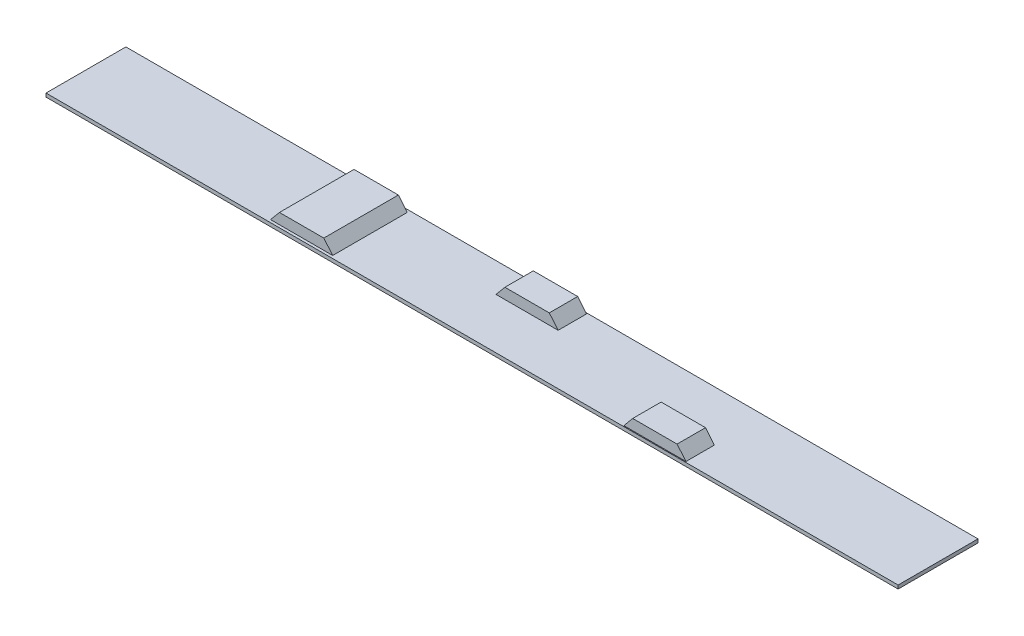
ISO-10303-21;
HEADER;
FILE_DESCRIPTION(('STEP AP214'),'2;1');
FILE_NAME('part.step','',(''),(''),'','','');
FILE_SCHEMA(('AUTOMOTIVE_DESIGN { 1 0 10303 214 1 1 1 1 }'));
ENDSEC;
DATA;
#1=APPLICATION_CONTEXT('core data for automotive mechanical design processes');
#2=APPLICATION_PROTOCOL_DEFINITION('international standard','automotive_design',2000,#1);
#3=PRODUCT_CONTEXT('',#1,'mechanical');
#4=PRODUCT('Part','Part','',(#3));
#5=PRODUCT_RELATED_PRODUCT_CATEGORY('part','',(#4));
#6=PRODUCT_DEFINITION_FORMATION('','',#4);
#7=PRODUCT_DEFINITION_CONTEXT('part definition',#1,'design');
#8=PRODUCT_DEFINITION('design','',#6,#7);
#9=PRODUCT_DEFINITION_SHAPE('','',#8);
#10=(LENGTH_UNIT() NAMED_UNIT(*) SI_UNIT(.MILLI.,.METRE.));
#11=(NAMED_UNIT(*) PLANE_ANGLE_UNIT() SI_UNIT($,.RADIAN.));
#12=(NAMED_UNIT(*) SI_UNIT($,.STERADIAN.) SOLID_ANGLE_UNIT());
#13=UNCERTAINTY_MEASURE_WITH_UNIT(LENGTH_MEASURE(1.E-05),#10,'distance_accuracy_value','');
#14=(GEOMETRIC_REPRESENTATION_CONTEXT(3) GLOBAL_UNCERTAINTY_ASSIGNED_CONTEXT((#13)) GLOBAL_UNIT_ASSIGNED_CONTEXT((#10,
#11,#12)) REPRESENTATION_CONTEXT('',''));
#15=CARTESIAN_POINT('',(0.,0.,0.));
#16=DIRECTION('',(0.,0.,1.));
#17=DIRECTION('',(1.,0.,0.));
#18=AXIS2_PLACEMENT_3D('',#15,#16,#17);
#19=CARTESIAN_POINT('',(0.,10.,0.));
#20=DIRECTION('',(0.,1.,0.));
#21=DIRECTION('',(0.,0.,1.));
#22=AXIS2_PLACEMENT_3D('',#19,#20,#21);
#23=PLANE('',#22);
#24=DIRECTION('',(0.,0.,-1.));
#25=VECTOR('',#24,1.);
#26=CARTESIAN_POINT('',(1200.,10.,-112.5));
#27=LINE('',#26,#25);
#28=CARTESIAN_POINT('',(1200.,10.,112.5));
#29=VERTEX_POINT('',#28);
#30=CARTESIAN_POINT('',(1200.,10.,-112.5));
#31=VERTEX_POINT('',#30);
#32=EDGE_CURVE('E249',#29,#31,#27,.T.);
#33=ORIENTED_EDGE('',*,*,#32,.T.);
#34=DIRECTION('',(-1.,0.,0.));
#35=VECTOR('',#34,1.);
#36=CARTESIAN_POINT('',(-1200.,10.,-112.5));
#37=LINE('',#36,#35);
#38=CARTESIAN_POINT('',(-1200.,10.,-112.5));
#39=VERTEX_POINT('',#38);
#40=EDGE_CURVE('E252',#31,#39,#37,.T.);
#41=ORIENTED_EDGE('',*,*,#40,.T.);
#42=DIRECTION('',(0.,0.,1.));
#43=VECTOR('',#42,1.);
#44=CARTESIAN_POINT('',(-1200.,10.,-112.5));
#45=LINE('',#44,#43);
#46=CARTESIAN_POINT('',(-1200.,10.,112.5));
#47=VERTEX_POINT('',#46);
#48=EDGE_CURVE('E255',#39,#47,#45,.T.);
#49=ORIENTED_EDGE('',*,*,#48,.T.);
#50=DIRECTION('',(1.,0.,0.));
#51=VECTOR('',#50,1.);
#52=CARTESIAN_POINT('',(-1200.,10.,112.5));
#53=LINE('',#52,#51);
#54=EDGE_CURVE('E257',#47,#29,#53,.T.);
#55=ORIENTED_EDGE('',*,*,#54,.T.);
#56=EDGE_LOOP('',(#33,#41,#49,#55));
#57=FACE_BOUND('',#56,.T.);
#58=DIRECTION('',(0.,0.,-1.));
#59=VECTOR('',#58,1.);
#60=CARTESIAN_POINT('',(599.999999999999,10.,110.));
#61=LINE('',#60,#59);
#62=CARTESIAN_POINT('',(599.999999999999,10.,110.));
#63=VERTEX_POINT('',#62);
#64=CARTESIAN_POINT('',(599.999999999999,10.,30.));
#65=VERTEX_POINT('',#64);
#66=EDGE_CURVE('E245',#63,#65,#61,.T.);
#67=ORIENTED_EDGE('',*,*,#66,.F.);
#68=DIRECTION('',(1.,0.,0.));
#69=VECTOR('',#68,1.);
#70=CARTESIAN_POINT('',(599.999999999999,10.,110.));
#71=LINE('',#70,#69);
#72=CARTESIAN_POINT('',(424.999999999999,10.,110.));
#73=VERTEX_POINT('',#72);
#74=EDGE_CURVE('E219',#73,#63,#71,.T.);
#75=ORIENTED_EDGE('',*,*,#74,.F.);
#76=DIRECTION('',(0.,0.,-1.));
#77=VECTOR('',#76,1.);
#78=CARTESIAN_POINT('',(424.999999999999,10.,110.));
#79=LINE('',#78,#77);
#80=CARTESIAN_POINT('',(424.999999999999,10.,30.));
#81=VERTEX_POINT('',#80);
#82=EDGE_CURVE('E230',#73,#81,#79,.T.);
#83=ORIENTED_EDGE('',*,*,#82,.T.);
#84=DIRECTION('',(1.,0.,0.));
#85=VECTOR('',#84,1.);
#86=CARTESIAN_POINT('',(599.999999999999,10.,30.));
#87=LINE('',#86,#85);
#88=EDGE_CURVE('E213',#81,#65,#87,.T.);
#89=ORIENTED_EDGE('',*,*,#88,.T.);
#90=EDGE_LOOP('',(#67,#75,#83,#89));
#91=FACE_BOUND('',#90,.T.);
#92=DIRECTION('',(0.,0.,1.));
#93=VECTOR('',#92,1.);
#94=CARTESIAN_POINT('',(-75.0000000000006,9.99999999999651,-110.));
#95=LINE('',#94,#93);
#96=CARTESIAN_POINT('',(-74.9999999999977,10.,-110.));
#97=VERTEX_POINT('',#96);
#98=CARTESIAN_POINT('',(-75.0000000000006,10.,-30.));
#99=VERTEX_POINT('',#98);
#100=EDGE_CURVE('E210',#97,#99,#95,.T.);
#101=ORIENTED_EDGE('',*,*,#100,.F.);
#102=DIRECTION('',(1.,0.,0.));
#103=VECTOR('',#102,1.);
#104=CARTESIAN_POINT('',(-75.0000000000006,9.99999999999651,-110.));
#105=LINE('',#104,#103);
#106=CARTESIAN_POINT('',(99.9999999999965,10.,-110.));
#107=VERTEX_POINT('',#106);
#108=EDGE_CURVE('E187',#97,#107,#105,.T.);
#109=ORIENTED_EDGE('',*,*,#108,.T.);
#110=DIRECTION('',(0.,0.,1.));
#111=VECTOR('',#110,1.);
#112=CARTESIAN_POINT('',(99.9999999999994,9.99999999999651,-110.));
#113=LINE('',#112,#111);
#114=CARTESIAN_POINT('',(99.9999999999994,9.99999999999651,-30.));
#115=VERTEX_POINT('',#114);
#116=EDGE_CURVE('E199',#107,#115,#113,.T.);
#117=ORIENTED_EDGE('',*,*,#116,.T.);
#118=DIRECTION('',(1.,0.,0.));
#119=VECTOR('',#118,1.);
#120=CARTESIAN_POINT('',(-75.0000000000006,9.99999999999651,-30.));
#121=LINE('',#120,#119);
#122=EDGE_CURVE('E183',#99,#115,#121,.T.);
#123=ORIENTED_EDGE('',*,*,#122,.F.);
#124=EDGE_LOOP('',(#101,#109,#117,#123));
#125=FACE_BOUND('',#124,.T.);
#126=DIRECTION('',(0.,0.,1.));
#127=VECTOR('',#126,1.);
#128=CARTESIAN_POINT('',(-575.000000000001,9.99999999999302,-105.));
#129=LINE('',#128,#127);
#130=CARTESIAN_POINT('',(-574.999999999995,10.,-105.));
#131=VERTEX_POINT('',#130);
#132=CARTESIAN_POINT('',(-575.000000000001,10.,105.));
#133=VERTEX_POINT('',#132);
#134=EDGE_CURVE('E57',#131,#133,#129,.T.);
#135=ORIENTED_EDGE('',*,*,#134,.F.);
#136=DIRECTION('',(1.,0.,0.));
#137=VECTOR('',#136,1.);
#138=CARTESIAN_POINT('',(-575.000000000001,9.99999999999302,-105.));
#139=LINE('',#138,#137);
#140=CARTESIAN_POINT('',(-400.000000000006,10.,-105.));
#141=VERTEX_POINT('',#140);
#142=EDGE_CURVE('E52',#131,#141,#139,.T.);
#143=ORIENTED_EDGE('',*,*,#142,.T.);
#144=DIRECTION('',(0.,0.,1.));
#145=VECTOR('',#144,1.);
#146=CARTESIAN_POINT('',(-400.000000000001,9.99999999999302,-105.));
#147=LINE('',#146,#145);
#148=CARTESIAN_POINT('',(-400.000000000001,9.99999999999302,105.));
#149=VERTEX_POINT('',#148);
#150=EDGE_CURVE('E184',#141,#149,#147,.T.);
#151=ORIENTED_EDGE('',*,*,#150,.T.);
#152=DIRECTION('',(1.,0.,0.));
#153=VECTOR('',#152,1.);
#154=CARTESIAN_POINT('',(-575.000000000001,9.99999999999302,105.));
#155=LINE('',#154,#153);
#156=EDGE_CURVE('E165',#133,#149,#155,.T.);
#157=ORIENTED_EDGE('',*,*,#156,.F.);
#158=EDGE_LOOP('',(#135,#143,#151,#157));
#159=FACE_BOUND('',#158,.T.);
#160=ADVANCED_FACE('F37',(#57,#91,#125,#159),#23,.T.);
#161=CARTESIAN_POINT('',(1200.,10.,-112.5));
#162=DIRECTION('',(-1.,0.,0.));
#163=DIRECTION('',(0.,0.,1.));
#164=AXIS2_PLACEMENT_3D('',#161,#162,#163);
#165=PLANE('',#164);
#166=DIRECTION('',(0.,0.,-1.));
#167=VECTOR('',#166,1.);
#168=CARTESIAN_POINT('',(1200.,0.,-112.5));
#169=LINE('',#168,#167);
#170=CARTESIAN_POINT('',(1200.,0.,112.5));
#171=VERTEX_POINT('',#170);
#172=CARTESIAN_POINT('',(1200.,0.,-112.5));
#173=VERTEX_POINT('',#172);
#174=EDGE_CURVE('E248',#171,#173,#169,.T.);
#175=ORIENTED_EDGE('',*,*,#174,.T.);
#176=DIRECTION('',(0.,-1.,0.));
#177=VECTOR('',#176,1.);
#178=CARTESIAN_POINT('',(1200.,10.,-112.5));
#179=LINE('',#178,#177);
#180=EDGE_CURVE('E11',#31,#173,#179,.T.);
#181=ORIENTED_EDGE('',*,*,#180,.F.);
#182=ORIENTED_EDGE('',*,*,#32,.F.);
#183=DIRECTION('',(0.,-1.,0.));
#184=VECTOR('',#183,1.);
#185=CARTESIAN_POINT('',(1200.,10.,112.5));
#186=LINE('',#185,#184);
#187=EDGE_CURVE('E259',#29,#171,#186,.T.);
#188=ORIENTED_EDGE('',*,*,#187,.T.);
#189=EDGE_LOOP('',(#175,#181,#182,#188));
#190=FACE_BOUND('',#189,.T.);
#191=ADVANCED_FACE('F39',(#190),#165,.F.);
#192=CARTESIAN_POINT('',(-1200.,10.,-112.5));
#193=DIRECTION('',(0.,0.,1.));
#194=DIRECTION('',(1.,0.,0.));
#195=AXIS2_PLACEMENT_3D('',#192,#193,#194);
#196=PLANE('',#195);
#197=DIRECTION('',(-1.,0.,0.));
#198=VECTOR('',#197,1.);
#199=CARTESIAN_POINT('',(-1200.,0.,-112.5));
#200=LINE('',#199,#198);
#201=CARTESIAN_POINT('',(-1200.,0.,-112.5));
#202=VERTEX_POINT('',#201);
#203=EDGE_CURVE('E262',#173,#202,#200,.T.);
#204=ORIENTED_EDGE('',*,*,#203,.T.);
#205=DIRECTION('',(0.,-1.,0.));
#206=VECTOR('',#205,1.);
#207=CARTESIAN_POINT('',(-1200.,10.,-112.5));
#208=LINE('',#207,#206);
#209=EDGE_CURVE('E45',#39,#202,#208,.T.);
#210=ORIENTED_EDGE('',*,*,#209,.F.);
#211=ORIENTED_EDGE('',*,*,#40,.F.);
#212=ORIENTED_EDGE('',*,*,#180,.T.);
#213=EDGE_LOOP('',(#204,#210,#211,#212));
#214=FACE_BOUND('',#213,.T.);
#215=ADVANCED_FACE('F292',(#214),#196,.F.);
#216=CARTESIAN_POINT('',(-1200.,10.,-112.5));
#217=DIRECTION('',(1.,0.,0.));
#218=DIRECTION('',(0.,0.,-1.));
#219=AXIS2_PLACEMENT_3D('',#216,#217,#218);
#220=PLANE('',#219);
#221=DIRECTION('',(0.,0.,1.));
#222=VECTOR('',#221,1.);
#223=CARTESIAN_POINT('',(-1200.,0.,-112.5));
#224=LINE('',#223,#222);
#225=CARTESIAN_POINT('',(-1200.,0.,112.5));
#226=VERTEX_POINT('',#225);
#227=EDGE_CURVE('E264',#202,#226,#224,.T.);
#228=ORIENTED_EDGE('',*,*,#227,.T.);
#229=DIRECTION('',(0.,-1.,0.));
#230=VECTOR('',#229,1.);
#231=CARTESIAN_POINT('',(-1200.,10.,112.5));
#232=LINE('',#231,#230);
#233=EDGE_CURVE('E269',#47,#226,#232,.T.);
#234=ORIENTED_EDGE('',*,*,#233,.F.);
#235=ORIENTED_EDGE('',*,*,#48,.F.);
#236=ORIENTED_EDGE('',*,*,#209,.T.);
#237=EDGE_LOOP('',(#228,#234,#235,#236));
#238=FACE_BOUND('',#237,.T.);
#239=ADVANCED_FACE('F276',(#238),#220,.F.);
#240=CARTESIAN_POINT('',(-1200.,10.,112.5));
#241=DIRECTION('',(0.,0.,-1.));
#242=DIRECTION('',(-1.,0.,0.));
#243=AXIS2_PLACEMENT_3D('',#240,#241,#242);
#244=PLANE('',#243);
#245=DIRECTION('',(1.,0.,0.));
#246=VECTOR('',#245,1.);
#247=CARTESIAN_POINT('',(-1200.,0.,112.5));
#248=LINE('',#247,#246);
#249=EDGE_CURVE('E253',#226,#171,#248,.T.);
#250=ORIENTED_EDGE('',*,*,#249,.T.);
#251=ORIENTED_EDGE('',*,*,#187,.F.);
#252=ORIENTED_EDGE('',*,*,#54,.F.);
#253=ORIENTED_EDGE('',*,*,#233,.T.);
#254=EDGE_LOOP('',(#250,#251,#252,#253));
#255=FACE_BOUND('',#254,.T.);
#256=ADVANCED_FACE('F285',(#255),#244,.F.);
#257=CARTESIAN_POINT('',(0.,0.,0.));
#258=DIRECTION('',(0.,1.,0.));
#259=DIRECTION('',(0.,0.,1.));
#260=AXIS2_PLACEMENT_3D('',#257,#258,#259);
#261=PLANE('',#260);
#262=ORIENTED_EDGE('',*,*,#174,.F.);
#263=ORIENTED_EDGE('',*,*,#249,.F.);
#264=ORIENTED_EDGE('',*,*,#227,.F.);
#265=ORIENTED_EDGE('',*,*,#203,.F.);
#266=EDGE_LOOP('',(#262,#263,#264,#265));
#267=FACE_BOUND('',#266,.T.);
#268=ADVANCED_FACE('F282',(#267),#261,.F.);
#269=CARTESIAN_POINT('',(574.999999999999,40.,110.));
#270=DIRECTION('',(-0.768221279597375,-0.640184399664481,0.));
#271=DIRECTION('',(0.640184399664481,-0.768221279597375,0.));
#272=AXIS2_PLACEMENT_3D('',#269,#270,#271);
#273=PLANE('',#272);
#274=DIRECTION('',(-0.640184399664481,0.768221279597375,0.));
#275=VECTOR('',#274,1.);
#276=CARTESIAN_POINT('',(574.999999999999,40.,30.));
#277=LINE('',#276,#275);
#278=CARTESIAN_POINT('',(574.999999999999,40.,30.));
#279=VERTEX_POINT('',#278);
#280=EDGE_CURVE('E232',#65,#279,#277,.T.);
#281=ORIENTED_EDGE('',*,*,#280,.T.);
#282=DIRECTION('',(0.,0.,-1.));
#283=VECTOR('',#282,1.);
#284=CARTESIAN_POINT('',(574.999999999999,40.,110.));
#285=LINE('',#284,#283);
#286=CARTESIAN_POINT('',(574.999999999999,40.,110.));
#287=VERTEX_POINT('',#286);
#288=EDGE_CURVE('E242',#287,#279,#285,.T.);
#289=ORIENTED_EDGE('',*,*,#288,.F.);
#290=DIRECTION('',(-0.640184399664481,0.768221279597375,0.));
#291=VECTOR('',#290,1.);
#292=CARTESIAN_POINT('',(574.999999999999,40.,110.));
#293=LINE('',#292,#291);
#294=EDGE_CURVE('E222',#63,#287,#293,.T.);
#295=ORIENTED_EDGE('',*,*,#294,.F.);
#296=ORIENTED_EDGE('',*,*,#66,.T.);
#297=EDGE_LOOP('',(#281,#289,#295,#296));
#298=FACE_BOUND('',#297,.T.);
#299=ADVANCED_FACE('F305',(#298),#273,.F.);
#300=CARTESIAN_POINT('',(449.999999999999,40.,110.));
#301=DIRECTION('',(0.,-1.,0.));
#302=DIRECTION('',(0.,0.,-1.));
#303=AXIS2_PLACEMENT_3D('',#300,#301,#302);
#304=PLANE('',#303);
#305=DIRECTION('',(-1.,0.,0.));
#306=VECTOR('',#305,1.);
#307=CARTESIAN_POINT('',(449.999999999999,40.,30.));
#308=LINE('',#307,#306);
#309=CARTESIAN_POINT('',(449.999999999999,40.,30.));
#310=VERTEX_POINT('',#309);
#311=EDGE_CURVE('E234',#279,#310,#308,.T.);
#312=ORIENTED_EDGE('',*,*,#311,.T.);
#313=DIRECTION('',(0.,0.,-1.));
#314=VECTOR('',#313,1.);
#315=CARTESIAN_POINT('',(449.999999999999,40.,110.));
#316=LINE('',#315,#314);
#317=CARTESIAN_POINT('',(449.999999999999,40.,110.));
#318=VERTEX_POINT('',#317);
#319=EDGE_CURVE('E239',#318,#310,#316,.T.);
#320=ORIENTED_EDGE('',*,*,#319,.F.);
#321=DIRECTION('',(-1.,0.,0.));
#322=VECTOR('',#321,1.);
#323=CARTESIAN_POINT('',(449.999999999999,40.,110.));
#324=LINE('',#323,#322);
#325=EDGE_CURVE('E225',#287,#318,#324,.T.);
#326=ORIENTED_EDGE('',*,*,#325,.F.);
#327=ORIENTED_EDGE('',*,*,#288,.T.);
#328=EDGE_LOOP('',(#312,#320,#326,#327));
#329=FACE_BOUND('',#328,.T.);
#330=ADVANCED_FACE('F324',(#329),#304,.F.);
#331=CARTESIAN_POINT('',(424.999999999999,10.,110.));
#332=DIRECTION('',(0.768221279597375,-0.640184399664481,0.));
#333=DIRECTION('',(0.640184399664481,0.768221279597375,0.));
#334=AXIS2_PLACEMENT_3D('',#331,#332,#333);
#335=PLANE('',#334);
#336=DIRECTION('',(-0.640184399664481,-0.768221279597375,0.));
#337=VECTOR('',#336,1.);
#338=CARTESIAN_POINT('',(424.999999999999,10.,30.));
#339=LINE('',#338,#337);
#340=EDGE_CURVE('E223',#310,#81,#339,.T.);
#341=ORIENTED_EDGE('',*,*,#340,.T.);
#342=ORIENTED_EDGE('',*,*,#82,.F.);
#343=DIRECTION('',(-0.640184399664481,-0.768221279597375,0.));
#344=VECTOR('',#343,1.);
#345=CARTESIAN_POINT('',(424.999999999999,10.,110.));
#346=LINE('',#345,#344);
#347=EDGE_CURVE('E227',#318,#73,#346,.T.);
#348=ORIENTED_EDGE('',*,*,#347,.F.);
#349=ORIENTED_EDGE('',*,*,#319,.T.);
#350=EDGE_LOOP('',(#341,#342,#348,#349));
#351=FACE_BOUND('',#350,.T.);
#352=ADVANCED_FACE('F331',(#351),#335,.F.);
#353=CARTESIAN_POINT('',(0.,0.,110.));
#354=DIRECTION('',(0.,0.,-1.));
#355=DIRECTION('',(-1.,0.,0.));
#356=AXIS2_PLACEMENT_3D('',#353,#354,#355);
#357=PLANE('',#356);
#358=ORIENTED_EDGE('',*,*,#74,.T.);
#359=ORIENTED_EDGE('',*,*,#294,.T.);
#360=ORIENTED_EDGE('',*,*,#325,.T.);
#361=ORIENTED_EDGE('',*,*,#347,.T.);
#362=EDGE_LOOP('',(#358,#359,#360,#361));
#363=FACE_BOUND('',#362,.T.);
#364=ADVANCED_FACE('F338',(#363),#357,.F.);
#365=CARTESIAN_POINT('',(0.,0.,30.));
#366=DIRECTION('',(0.,0.,-1.));
#367=DIRECTION('',(-1.,0.,0.));
#368=AXIS2_PLACEMENT_3D('',#365,#366,#367);
#369=PLANE('',#368);
#370=ORIENTED_EDGE('',*,*,#88,.F.);
#371=ORIENTED_EDGE('',*,*,#340,.F.);
#372=ORIENTED_EDGE('',*,*,#311,.F.);
#373=ORIENTED_EDGE('',*,*,#280,.F.);
#374=EDGE_LOOP('',(#370,#371,#372,#373));
#375=FACE_BOUND('',#374,.T.);
#376=ADVANCED_FACE('F346',(#375),#369,.T.);
#377=CARTESIAN_POINT('',(-50.0000000000006,39.9999999999965,-110.));
#378=DIRECTION('',(-0.768221279597375,0.640184399664481,0.));
#379=DIRECTION('',(-0.640184399664481,-0.768221279597375,0.));
#380=AXIS2_PLACEMENT_3D('',#377,#378,#379);
#381=PLANE('',#380);
#382=DIRECTION('',(-0.640184399664481,-0.768221279597375,0.));
#383=VECTOR('',#382,1.);
#384=CARTESIAN_POINT('',(-50.0000000000006,39.9999999999965,-30.));
#385=LINE('',#384,#383);
#386=CARTESIAN_POINT('',(-50.0000000000006,39.9999999999965,-30.));
#387=VERTEX_POINT('',#386);
#388=EDGE_CURVE('E190',#387,#99,#385,.T.);
#389=ORIENTED_EDGE('',*,*,#388,.F.);
#390=DIRECTION('',(0.,0.,1.));
#391=VECTOR('',#390,1.);
#392=CARTESIAN_POINT('',(-50.0000000000006,39.9999999999965,-110.));
#393=LINE('',#392,#391);
#394=CARTESIAN_POINT('',(-50.0000000000006,39.9999999999965,-110.));
#395=VERTEX_POINT('',#394);
#396=EDGE_CURVE('E214',#395,#387,#393,.T.);
#397=ORIENTED_EDGE('',*,*,#396,.F.);
#398=DIRECTION('',(-0.640184399664481,-0.768221279597375,0.));
#399=VECTOR('',#398,1.);
#400=CARTESIAN_POINT('',(-50.0000000000006,39.9999999999965,-110.));
#401=LINE('',#400,#399);
#402=EDGE_CURVE('E196',#395,#97,#401,.T.);
#403=ORIENTED_EDGE('',*,*,#402,.T.);
#404=ORIENTED_EDGE('',*,*,#100,.T.);
#405=EDGE_LOOP('',(#389,#397,#403,#404));
#406=FACE_BOUND('',#405,.T.);
#407=ADVANCED_FACE('F354',(#406),#381,.T.);
#408=CARTESIAN_POINT('',(74.9999999999994,39.9999999999965,-110.));
#409=DIRECTION('',(0.,1.,0.));
#410=DIRECTION('',(0.,0.,1.));
#411=AXIS2_PLACEMENT_3D('',#408,#409,#410);
#412=PLANE('',#411);
#413=DIRECTION('',(-1.,0.,0.));
#414=VECTOR('',#413,1.);
#415=CARTESIAN_POINT('',(74.9999999999994,39.9999999999965,-30.));
#416=LINE('',#415,#414);
#417=CARTESIAN_POINT('',(74.9999999999994,39.9999999999965,-30.));
#418=VERTEX_POINT('',#417);
#419=EDGE_CURVE('E205',#418,#387,#416,.T.);
#420=ORIENTED_EDGE('',*,*,#419,.F.);
#421=DIRECTION('',(0.,0.,1.));
#422=VECTOR('',#421,1.);
#423=CARTESIAN_POINT('',(74.9999999999994,39.9999999999965,-110.));
#424=LINE('',#423,#422);
#425=CARTESIAN_POINT('',(74.9999999999994,39.9999999999965,-110.));
#426=VERTEX_POINT('',#425);
#427=EDGE_CURVE('E216',#426,#418,#424,.T.);
#428=ORIENTED_EDGE('',*,*,#427,.F.);
#429=DIRECTION('',(-1.,0.,0.));
#430=VECTOR('',#429,1.);
#431=CARTESIAN_POINT('',(74.9999999999994,39.9999999999965,-110.));
#432=LINE('',#431,#430);
#433=EDGE_CURVE('E193',#426,#395,#432,.T.);
#434=ORIENTED_EDGE('',*,*,#433,.T.);
#435=ORIENTED_EDGE('',*,*,#396,.T.);
#436=EDGE_LOOP('',(#420,#428,#434,#435));
#437=FACE_BOUND('',#436,.T.);
#438=ADVANCED_FACE('F362',(#437),#412,.T.);
#439=CARTESIAN_POINT('',(99.9999999999994,9.99999999999651,-110.));
#440=DIRECTION('',(0.768221279597375,0.640184399664481,0.));
#441=DIRECTION('',(-0.640184399664481,0.768221279597375,0.));
#442=AXIS2_PLACEMENT_3D('',#439,#440,#441);
#443=PLANE('',#442);
#444=DIRECTION('',(-0.640184399664481,0.768221279597375,0.));
#445=VECTOR('',#444,1.);
#446=CARTESIAN_POINT('',(99.9999999999994,9.99999999999651,-30.));
#447=LINE('',#446,#445);
#448=EDGE_CURVE('E202',#115,#418,#447,.T.);
#449=ORIENTED_EDGE('',*,*,#448,.F.);
#450=ORIENTED_EDGE('',*,*,#116,.F.);
#451=DIRECTION('',(-0.640184399664481,0.768221279597375,0.));
#452=VECTOR('',#451,1.);
#453=CARTESIAN_POINT('',(99.9999999999994,9.99999999999651,-110.));
#454=LINE('',#453,#452);
#455=EDGE_CURVE('E189',#107,#426,#454,.T.);
#456=ORIENTED_EDGE('',*,*,#455,.T.);
#457=ORIENTED_EDGE('',*,*,#427,.T.);
#458=EDGE_LOOP('',(#449,#450,#456,#457));
#459=FACE_BOUND('',#458,.T.);
#460=ADVANCED_FACE('F370',(#459),#443,.T.);
#461=CARTESIAN_POINT('',(0.,0.,-110.));
#462=DIRECTION('',(0.,0.,1.));
#463=DIRECTION('',(1.,0.,0.));
#464=AXIS2_PLACEMENT_3D('',#461,#462,#463);
#465=PLANE('',#464);
#466=ORIENTED_EDGE('',*,*,#108,.F.);
#467=ORIENTED_EDGE('',*,*,#402,.F.);
#468=ORIENTED_EDGE('',*,*,#433,.F.);
#469=ORIENTED_EDGE('',*,*,#455,.F.);
#470=EDGE_LOOP('',(#466,#467,#468,#469));
#471=FACE_BOUND('',#470,.T.);
#472=ADVANCED_FACE('F378',(#471),#465,.F.);
#473=CARTESIAN_POINT('',(0.,0.,-30.));
#474=DIRECTION('',(0.,0.,1.));
#475=DIRECTION('',(1.,0.,0.));
#476=AXIS2_PLACEMENT_3D('',#473,#474,#475);
#477=PLANE('',#476);
#478=ORIENTED_EDGE('',*,*,#122,.T.);
#479=ORIENTED_EDGE('',*,*,#448,.T.);
#480=ORIENTED_EDGE('',*,*,#419,.T.);
#481=ORIENTED_EDGE('',*,*,#388,.T.);
#482=EDGE_LOOP('',(#478,#479,#480,#481));
#483=FACE_BOUND('',#482,.T.);
#484=ADVANCED_FACE('F386',(#483),#477,.T.);
#485=CARTESIAN_POINT('',(-425.000000000001,39.999999999993,-105.));
#486=DIRECTION('',(0.,1.,0.));
#487=DIRECTION('',(0.,0.,1.));
#488=AXIS2_PLACEMENT_3D('',#485,#486,#487);
#489=PLANE('',#488);
#490=DIRECTION('',(0.,0.,1.));
#491=VECTOR('',#490,1.);
#492=CARTESIAN_POINT('',(-550.000000000001,39.999999999993,-105.));
#493=LINE('',#492,#491);
#494=CARTESIAN_POINT('',(-550.000000000001,39.999999999993,-105.));
#495=VERTEX_POINT('',#494);
#496=CARTESIAN_POINT('',(-550.000000000001,39.999999999993,105.));
#497=VERTEX_POINT('',#496);
#498=EDGE_CURVE('E148',#495,#497,#493,.T.);
#499=ORIENTED_EDGE('',*,*,#498,.T.);
#500=DIRECTION('',(-1.,0.,0.));
#501=VECTOR('',#500,1.);
#502=CARTESIAN_POINT('',(-425.000000000001,39.999999999993,105.));
#503=LINE('',#502,#501);
#504=CARTESIAN_POINT('',(-425.000000000001,39.999999999993,105.));
#505=VERTEX_POINT('',#504);
#506=EDGE_CURVE('E152',#505,#497,#503,.T.);
#507=ORIENTED_EDGE('',*,*,#506,.F.);
#508=DIRECTION('',(0.,0.,1.));
#509=VECTOR('',#508,1.);
#510=CARTESIAN_POINT('',(-425.000000000001,39.999999999993,-105.));
#511=LINE('',#510,#509);
#512=CARTESIAN_POINT('',(-425.000000000001,39.999999999993,-105.));
#513=VERTEX_POINT('',#512);
#514=EDGE_CURVE('E181',#513,#505,#511,.T.);
#515=ORIENTED_EDGE('',*,*,#514,.F.);
#516=DIRECTION('',(-1.,0.,0.));
#517=VECTOR('',#516,1.);
#518=CARTESIAN_POINT('',(-425.000000000001,39.999999999993,-105.));
#519=LINE('',#518,#517);
#520=EDGE_CURVE('E154',#513,#495,#519,.T.);
#521=ORIENTED_EDGE('',*,*,#520,.T.);
#522=EDGE_LOOP('',(#499,#507,#515,#521));
#523=FACE_BOUND('',#522,.T.);
#524=ADVANCED_FACE('F150',(#523),#489,.T.);
#525=CARTESIAN_POINT('',(-400.000000000001,9.99999999999302,-105.));
#526=DIRECTION('',(0.768221279597375,0.640184399664481,0.));
#527=DIRECTION('',(-0.640184399664481,0.768221279597375,0.));
#528=AXIS2_PLACEMENT_3D('',#525,#526,#527);
#529=PLANE('',#528);
#530=ORIENTED_EDGE('',*,*,#514,.T.);
#531=DIRECTION('',(-0.640184399664481,0.768221279597375,0.));
#532=VECTOR('',#531,1.);
#533=CARTESIAN_POINT('',(-400.000000000001,9.99999999999302,105.));
#534=LINE('',#533,#532);
#535=EDGE_CURVE('E170',#149,#505,#534,.T.);
#536=ORIENTED_EDGE('',*,*,#535,.F.);
#537=ORIENTED_EDGE('',*,*,#150,.F.);
#538=DIRECTION('',(-0.640184399664481,0.768221279597375,0.));
#539=VECTOR('',#538,1.);
#540=CARTESIAN_POINT('',(-400.000000000001,9.99999999999302,-105.));
#541=LINE('',#540,#539);
#542=EDGE_CURVE('E158',#141,#513,#541,.T.);
#543=ORIENTED_EDGE('',*,*,#542,.T.);
#544=EDGE_LOOP('',(#530,#536,#537,#543));
#545=FACE_BOUND('',#544,.T.);
#546=ADVANCED_FACE('F401',(#545),#529,.T.);
#547=CARTESIAN_POINT('',(-550.000000000001,39.999999999993,-105.));
#548=DIRECTION('',(-0.768221279597375,0.640184399664481,0.));
#549=DIRECTION('',(-0.640184399664481,-0.768221279597375,0.));
#550=AXIS2_PLACEMENT_3D('',#547,#548,#549);
#551=PLANE('',#550);
#552=ORIENTED_EDGE('',*,*,#134,.T.);
#553=DIRECTION('',(-0.640184399664481,-0.768221279597375,0.));
#554=VECTOR('',#553,1.);
#555=CARTESIAN_POINT('',(-550.000000000001,39.999999999993,105.));
#556=LINE('',#555,#554);
#557=EDGE_CURVE('E161',#497,#133,#556,.T.);
#558=ORIENTED_EDGE('',*,*,#557,.F.);
#559=ORIENTED_EDGE('',*,*,#498,.F.);
#560=DIRECTION('',(-0.640184399664481,-0.768221279597375,0.));
#561=VECTOR('',#560,1.);
#562=CARTESIAN_POINT('',(-550.000000000001,39.999999999993,-105.));
#563=LINE('',#562,#561);
#564=EDGE_CURVE('E176',#495,#131,#563,.T.);
#565=ORIENTED_EDGE('',*,*,#564,.T.);
#566=EDGE_LOOP('',(#552,#558,#559,#565));
#567=FACE_BOUND('',#566,.T.);
#568=ADVANCED_FACE('F162',(#567),#551,.T.);
#569=CARTESIAN_POINT('',(0.,0.,-105.));
#570=DIRECTION('',(0.,0.,1.));
#571=DIRECTION('',(1.,0.,0.));
#572=AXIS2_PLACEMENT_3D('',#569,#570,#571);
#573=PLANE('',#572);
#574=ORIENTED_EDGE('',*,*,#520,.F.);
#575=ORIENTED_EDGE('',*,*,#542,.F.);
#576=ORIENTED_EDGE('',*,*,#142,.F.);
#577=ORIENTED_EDGE('',*,*,#564,.F.);
#578=EDGE_LOOP('',(#574,#575,#576,#577));
#579=FACE_BOUND('',#578,.T.);
#580=ADVANCED_FACE('F415',(#579),#573,.F.);
#581=CARTESIAN_POINT('',(0.,0.,105.));
#582=DIRECTION('',(0.,0.,1.));
#583=DIRECTION('',(1.,0.,0.));
#584=AXIS2_PLACEMENT_3D('',#581,#582,#583);
#585=PLANE('',#584);
#586=ORIENTED_EDGE('',*,*,#506,.T.);
#587=ORIENTED_EDGE('',*,*,#557,.T.);
#588=ORIENTED_EDGE('',*,*,#156,.T.);
#589=ORIENTED_EDGE('',*,*,#535,.T.);
#590=EDGE_LOOP('',(#586,#587,#588,#589));
#591=FACE_BOUND('',#590,.T.);
#592=ADVANCED_FACE('F168',(#591),#585,.T.);
#593=CLOSED_SHELL('',(#160,#191,#215,#239,#256,#268,#299,#330,#352,#364,#376,#407,#438,#460,
#472,#484,#524,#546,#568,#580,#592));
#594=MANIFOLD_SOLID_BREP('B2',#593);
#595=ADVANCED_BREP_SHAPE_REPRESENTATION('',(#18,#594),#14);
#596=SHAPE_DEFINITION_REPRESENTATION(#9,#595);
ENDSEC;
END-ISO-10303-21;
